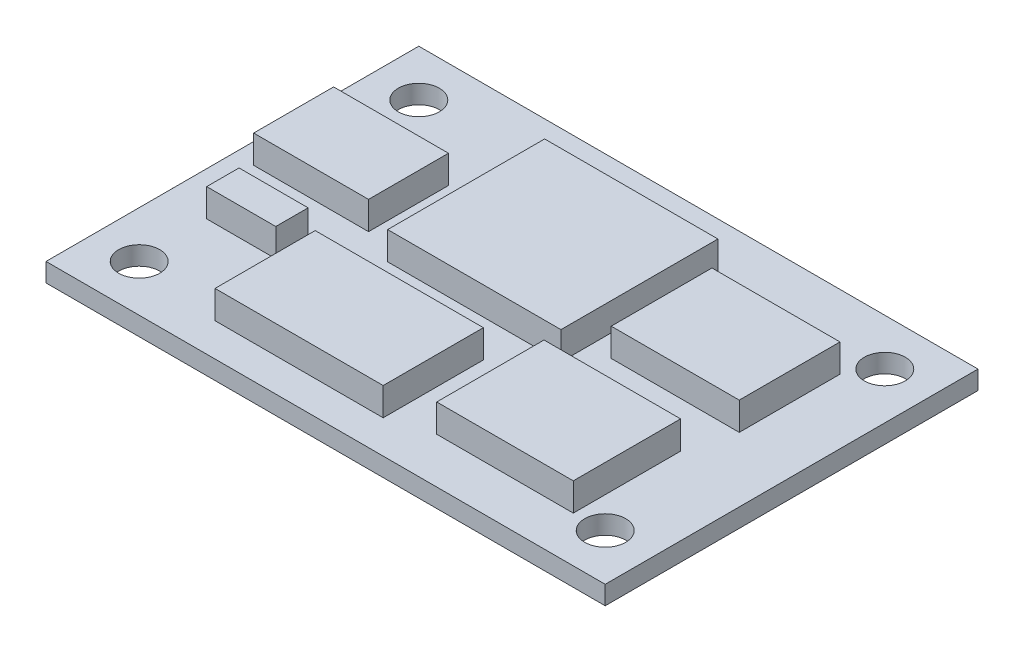
ISO-10303-21;
HEADER;
FILE_DESCRIPTION(('STEP AP214'),'2;1');
FILE_NAME('part.step','',(''),(''),'','','');
FILE_SCHEMA(('AUTOMOTIVE_DESIGN { 1 0 10303 214 1 1 1 1 }'));
ENDSEC;
DATA;
#1=APPLICATION_CONTEXT('core data for automotive mechanical design processes');
#2=APPLICATION_PROTOCOL_DEFINITION('international standard','automotive_design',2000,#1);
#3=PRODUCT_CONTEXT('',#1,'mechanical');
#4=PRODUCT('Part','Part','',(#3));
#5=PRODUCT_RELATED_PRODUCT_CATEGORY('part','',(#4));
#6=PRODUCT_DEFINITION_FORMATION('','',#4);
#7=PRODUCT_DEFINITION_CONTEXT('part definition',#1,'design');
#8=PRODUCT_DEFINITION('design','',#6,#7);
#9=PRODUCT_DEFINITION_SHAPE('','',#8);
#10=(LENGTH_UNIT() NAMED_UNIT(*) SI_UNIT(.MILLI.,.METRE.));
#11=(NAMED_UNIT(*) PLANE_ANGLE_UNIT() SI_UNIT($,.RADIAN.));
#12=(NAMED_UNIT(*) SI_UNIT($,.STERADIAN.) SOLID_ANGLE_UNIT());
#13=UNCERTAINTY_MEASURE_WITH_UNIT(LENGTH_MEASURE(1.E-05),#10,'distance_accuracy_value','');
#14=(GEOMETRIC_REPRESENTATION_CONTEXT(3) GLOBAL_UNCERTAINTY_ASSIGNED_CONTEXT((#13)) GLOBAL_UNIT_ASSIGNED_CONTEXT((#10,
#11,#12)) REPRESENTATION_CONTEXT('',''));
#15=CARTESIAN_POINT('',(0.,0.,0.));
#16=DIRECTION('',(0.,0.,1.));
#17=DIRECTION('',(1.,0.,0.));
#18=AXIS2_PLACEMENT_3D('',#15,#16,#17);
#19=CARTESIAN_POINT('',(0.,2.,0.));
#20=DIRECTION('',(0.,1.,0.));
#21=DIRECTION('',(0.,0.,1.));
#22=AXIS2_PLACEMENT_3D('',#19,#20,#21);
#23=PLANE('',#22);
#24=CARTESIAN_POINT('',(-25.,2.,-15.));
#25=DIRECTION('',(0.,1.,0.));
#26=DIRECTION('',(0.,0.,1.));
#27=AXIS2_PLACEMENT_3D('',#24,#25,#26);
#28=CIRCLE('',#27,2.2);
#29=CARTESIAN_POINT('',(-25.,2.,-12.8));
#30=VERTEX_POINT('',#29);
#31=EDGE_CURVE('E823',#30,#30,#28,.T.);
#32=ORIENTED_EDGE('',*,*,#31,.F.);
#33=EDGE_LOOP('',(#32));
#34=FACE_BOUND('',#33,.T.);
#35=CARTESIAN_POINT('',(25.,2.,-15.));
#36=DIRECTION('',(0.,1.,0.));
#37=DIRECTION('',(0.,0.,1.));
#38=AXIS2_PLACEMENT_3D('',#35,#36,#37);
#39=CIRCLE('',#38,2.2);
#40=CARTESIAN_POINT('',(25.,2.,-12.8));
#41=VERTEX_POINT('',#40);
#42=EDGE_CURVE('E825',#41,#41,#39,.T.);
#43=ORIENTED_EDGE('',*,*,#42,.F.);
#44=EDGE_LOOP('',(#43));
#45=FACE_BOUND('',#44,.T.);
#46=CARTESIAN_POINT('',(25.,2.,15.));
#47=DIRECTION('',(0.,1.,0.));
#48=DIRECTION('',(0.,0.,1.));
#49=AXIS2_PLACEMENT_3D('',#46,#47,#48);
#50=CIRCLE('',#49,2.2);
#51=CARTESIAN_POINT('',(25.,2.,17.2));
#52=VERTEX_POINT('',#51);
#53=EDGE_CURVE('E833',#52,#52,#50,.T.);
#54=ORIENTED_EDGE('',*,*,#53,.F.);
#55=EDGE_LOOP('',(#54));
#56=FACE_BOUND('',#55,.T.);
#57=CARTESIAN_POINT('',(-25.,2.,15.));
#58=DIRECTION('',(0.,1.,0.));
#59=DIRECTION('',(0.,0.,1.));
#60=AXIS2_PLACEMENT_3D('',#57,#58,#59);
#61=CIRCLE('',#60,2.2);
#62=CARTESIAN_POINT('',(-25.,2.,17.2));
#63=VERTEX_POINT('',#62);
#64=EDGE_CURVE('E839',#63,#63,#61,.T.);
#65=ORIENTED_EDGE('',*,*,#64,.F.);
#66=EDGE_LOOP('',(#65));
#67=FACE_BOUND('',#66,.T.);
#68=DIRECTION('',(-1.,0.,0.));
#69=VECTOR('',#68,1.);
#70=CARTESIAN_POINT('',(7.01914534805326,2.,3.58394866051981));
#71=LINE('',#70,#69);
#72=CARTESIAN_POINT('',(21.6740380104312,2.,3.58394866051981));
#73=VERTEX_POINT('',#72);
#74=CARTESIAN_POINT('',(7.01914534805326,2.,3.58394866051981));
#75=VERTEX_POINT('',#74);
#76=EDGE_CURVE('E247',#73,#75,#71,.T.);
#77=ORIENTED_EDGE('',*,*,#76,.F.);
#78=DIRECTION('',(0.,0.,-1.));
#79=VECTOR('',#78,1.);
#80=CARTESIAN_POINT('',(21.6740380104312,2.,3.58394866051981));
#81=LINE('',#80,#79);
#82=CARTESIAN_POINT('',(21.6740380104312,2.,15.0978446505121));
#83=VERTEX_POINT('',#82);
#84=EDGE_CURVE('E244',#83,#73,#81,.T.);
#85=ORIENTED_EDGE('',*,*,#84,.F.);
#86=DIRECTION('',(1.,0.,0.));
#87=VECTOR('',#86,1.);
#88=CARTESIAN_POINT('',(7.01914534805326,2.,15.0978446505121));
#89=LINE('',#88,#87);
#90=CARTESIAN_POINT('',(7.01914534805326,2.,15.0978446505121));
#91=VERTEX_POINT('',#90);
#92=EDGE_CURVE('E256',#91,#83,#89,.T.);
#93=ORIENTED_EDGE('',*,*,#92,.F.);
#94=DIRECTION('',(0.,0.,1.));
#95=VECTOR('',#94,1.);
#96=CARTESIAN_POINT('',(7.01914534805326,2.,3.58394866051981));
#97=LINE('',#96,#95);
#98=EDGE_CURVE('E264',#75,#91,#97,.T.);
#99=ORIENTED_EDGE('',*,*,#98,.F.);
#100=EDGE_LOOP('',(#77,#85,#93,#99));
#101=FACE_BOUND('',#100,.T.);
#102=DIRECTION('',(1.,0.,0.));
#103=VECTOR('',#102,1.);
#104=CARTESIAN_POINT('',(6.96204624759389,2.,1.70936498631136));
#105=LINE('',#104,#103);
#106=CARTESIAN_POINT('',(-11.6307817870052,2.,1.70936498631136));
#107=VERTEX_POINT('',#106);
#108=CARTESIAN_POINT('',(6.96204624759389,2.,1.70936498631136));
#109=VERTEX_POINT('',#108);
#110=EDGE_CURVE('E318',#107,#109,#105,.T.);
#111=ORIENTED_EDGE('',*,*,#110,.F.);
#112=DIRECTION('',(0.,0.,1.));
#113=VECTOR('',#112,1.);
#114=CARTESIAN_POINT('',(-11.6307817870052,2.,-15.1333634497064));
#115=LINE('',#114,#113);
#116=CARTESIAN_POINT('',(-11.6307817870052,2.,-15.1333634497064));
#117=VERTEX_POINT('',#116);
#118=EDGE_CURVE('E304',#117,#107,#115,.T.);
#119=ORIENTED_EDGE('',*,*,#118,.F.);
#120=DIRECTION('',(-1.,0.,0.));
#121=VECTOR('',#120,1.);
#122=CARTESIAN_POINT('',(6.96204624759389,2.,-15.1333634497064));
#123=LINE('',#122,#121);
#124=CARTESIAN_POINT('',(6.96204624759389,2.,-15.1333634497064));
#125=VERTEX_POINT('',#124);
#126=EDGE_CURVE('E309',#125,#117,#123,.T.);
#127=ORIENTED_EDGE('',*,*,#126,.F.);
#128=DIRECTION('',(0.,0.,-1.));
#129=VECTOR('',#128,1.);
#130=CARTESIAN_POINT('',(6.96204624759389,2.,-15.1333634497064));
#131=LINE('',#130,#129);
#132=EDGE_CURVE('E320',#109,#125,#131,.T.);
#133=ORIENTED_EDGE('',*,*,#132,.F.);
#134=EDGE_LOOP('',(#111,#119,#127,#133));
#135=FACE_BOUND('',#134,.T.);
#136=DIRECTION('',(1.,0.,0.));
#137=VECTOR('',#136,1.);
#138=CARTESIAN_POINT('',(-15.4625245919533,2.,-0.070739530755759));
#139=LINE('',#138,#137);
#140=CARTESIAN_POINT('',(-27.788807655071,2.,-0.0707395307557573));
#141=VERTEX_POINT('',#140);
#142=CARTESIAN_POINT('',(-15.4625245919533,2.,-0.070739530755759));
#143=VERTEX_POINT('',#142);
#144=EDGE_CURVE('E376',#141,#143,#139,.T.);
#145=ORIENTED_EDGE('',*,*,#144,.F.);
#146=DIRECTION('',(0.,0.,1.));
#147=VECTOR('',#146,1.);
#148=CARTESIAN_POINT('',(-27.788807655071,2.,-8.64585092567438));
#149=LINE('',#148,#147);
#150=CARTESIAN_POINT('',(-27.788807655071,2.,-8.64585092567438));
#151=VERTEX_POINT('',#150);
#152=EDGE_CURVE('E362',#151,#141,#149,.T.);
#153=ORIENTED_EDGE('',*,*,#152,.F.);
#154=DIRECTION('',(-1.,0.,0.));
#155=VECTOR('',#154,1.);
#156=CARTESIAN_POINT('',(-15.4625245919533,2.,-8.64585092567438));
#157=LINE('',#156,#155);
#158=CARTESIAN_POINT('',(-15.4625245919533,2.,-8.64585092567438));
#159=VERTEX_POINT('',#158);
#160=EDGE_CURVE('E367',#159,#151,#157,.T.);
#161=ORIENTED_EDGE('',*,*,#160,.F.);
#162=DIRECTION('',(0.,0.,-1.));
#163=VECTOR('',#162,1.);
#164=CARTESIAN_POINT('',(-15.4625245919533,2.,-8.64585092567438));
#165=LINE('',#164,#163);
#166=EDGE_CURVE('E378',#143,#159,#165,.T.);
#167=ORIENTED_EDGE('',*,*,#166,.F.);
#168=EDGE_LOOP('',(#145,#153,#161,#167));
#169=FACE_BOUND('',#168,.T.);
#170=DIRECTION('',(0.,0.,1.));
#171=VECTOR('',#170,1.);
#172=CARTESIAN_POINT('',(-30.,2.,20.));
#173=LINE('',#172,#171);
#174=CARTESIAN_POINT('',(-30.,2.,-20.));
#175=VERTEX_POINT('',#174);
#176=CARTESIAN_POINT('',(-30.,2.,20.));
#177=VERTEX_POINT('',#176);
#178=EDGE_CURVE('E392',#175,#177,#173,.T.);
#179=ORIENTED_EDGE('',*,*,#178,.T.);
#180=DIRECTION('',(1.,0.,0.));
#181=VECTOR('',#180,1.);
#182=CARTESIAN_POINT('',(30.,2.,20.));
#183=LINE('',#182,#181);
#184=CARTESIAN_POINT('',(30.,2.,20.));
#185=VERTEX_POINT('',#184);
#186=EDGE_CURVE('E395',#177,#185,#183,.T.);
#187=ORIENTED_EDGE('',*,*,#186,.T.);
#188=DIRECTION('',(0.,0.,-1.));
#189=VECTOR('',#188,1.);
#190=CARTESIAN_POINT('',(30.,2.,20.));
#191=LINE('',#190,#189);
#192=CARTESIAN_POINT('',(30.,2.,-20.));
#193=VERTEX_POINT('',#192);
#194=EDGE_CURVE('E398',#185,#193,#191,.T.);
#195=ORIENTED_EDGE('',*,*,#194,.T.);
#196=DIRECTION('',(-1.,0.,0.));
#197=VECTOR('',#196,1.);
#198=CARTESIAN_POINT('',(30.,2.,-20.));
#199=LINE('',#198,#197);
#200=EDGE_CURVE('E400',#193,#175,#199,.T.);
#201=ORIENTED_EDGE('',*,*,#200,.T.);
#202=EDGE_LOOP('',(#179,#187,#195,#201));
#203=FACE_BOUND('',#202,.T.);
#204=DIRECTION('',(1.,0.,0.));
#205=VECTOR('',#204,1.);
#206=CARTESIAN_POINT('',(23.0758575930636,2.,-1.30752796441413));
#207=LINE('',#206,#205);
#208=CARTESIAN_POINT('',(9.33847301958934,2.,-1.30752796441413));
#209=VERTEX_POINT('',#208);
#210=CARTESIAN_POINT('',(23.0758575930636,2.,-1.30752796441413));
#211=VERTEX_POINT('',#210);
#212=EDGE_CURVE('E347',#209,#211,#207,.T.);
#213=ORIENTED_EDGE('',*,*,#212,.F.);
#214=DIRECTION('',(0.,0.,1.));
#215=VECTOR('',#214,1.);
#216=CARTESIAN_POINT('',(9.33847301958934,2.,-12.1164704989809));
#217=LINE('',#216,#215);
#218=CARTESIAN_POINT('',(9.33847301958934,2.,-12.1164704989809));
#219=VERTEX_POINT('',#218);
#220=EDGE_CURVE('E333',#219,#209,#217,.T.);
#221=ORIENTED_EDGE('',*,*,#220,.F.);
#222=DIRECTION('',(-1.,0.,0.));
#223=VECTOR('',#222,1.);
#224=CARTESIAN_POINT('',(23.0758575930636,2.,-12.1164704989809));
#225=LINE('',#224,#223);
#226=CARTESIAN_POINT('',(23.0758575930636,2.,-12.1164704989809));
#227=VERTEX_POINT('',#226);
#228=EDGE_CURVE('E338',#227,#219,#225,.T.);
#229=ORIENTED_EDGE('',*,*,#228,.F.);
#230=DIRECTION('',(0.,0.,-1.));
#231=VECTOR('',#230,1.);
#232=CARTESIAN_POINT('',(23.0758575930636,2.,-12.1164704989809));
#233=LINE('',#232,#231);
#234=EDGE_CURVE('E349',#211,#227,#233,.T.);
#235=ORIENTED_EDGE('',*,*,#234,.F.);
#236=EDGE_LOOP('',(#213,#221,#229,#235));
#237=FACE_BOUND('',#236,.T.);
#238=DIRECTION('',(1.,0.,0.));
#239=VECTOR('',#238,1.);
#240=CARTESIAN_POINT('',(-17.9198734394674,2.,7.42768358096558));
#241=LINE('',#240,#239);
#242=CARTESIAN_POINT('',(-25.3314588075568,2.,7.42768358096558));
#243=VERTEX_POINT('',#242);
#244=CARTESIAN_POINT('',(-17.9198734394674,2.,7.42768358096558));
#245=VERTEX_POINT('',#244);
#246=EDGE_CURVE('E289',#243,#245,#241,.T.);
#247=ORIENTED_EDGE('',*,*,#246,.F.);
#248=DIRECTION('',(0.,0.,1.));
#249=VECTOR('',#248,1.);
#250=CARTESIAN_POINT('',(-25.3314588075568,2.,3.9564800150288));
#251=LINE('',#250,#249);
#252=CARTESIAN_POINT('',(-25.3314588075568,2.,3.9564800150288));
#253=VERTEX_POINT('',#252);
#254=EDGE_CURVE('E275',#253,#243,#251,.T.);
#255=ORIENTED_EDGE('',*,*,#254,.F.);
#256=DIRECTION('',(-1.,0.,0.));
#257=VECTOR('',#256,1.);
#258=CARTESIAN_POINT('',(-17.9198734394674,2.,3.9564800150288));
#259=LINE('',#258,#257);
#260=CARTESIAN_POINT('',(-17.9198734394674,2.,3.9564800150288));
#261=VERTEX_POINT('',#260);
#262=EDGE_CURVE('E280',#261,#253,#259,.T.);
#263=ORIENTED_EDGE('',*,*,#262,.F.);
#264=DIRECTION('',(0.,0.,-1.));
#265=VECTOR('',#264,1.);
#266=CARTESIAN_POINT('',(-17.9198734394674,2.,3.9564800150288));
#267=LINE('',#266,#265);
#268=EDGE_CURVE('E291',#245,#261,#267,.T.);
#269=ORIENTED_EDGE('',*,*,#268,.F.);
#270=EDGE_LOOP('',(#247,#255,#263,#269));
#271=FACE_BOUND('',#270,.T.);
#272=DIRECTION('',(1.,0.,0.));
#273=VECTOR('',#272,1.);
#274=CARTESIAN_POINT('',(2.6187010722979,2.,16.4404738050962));
#275=LINE('',#274,#273);
#276=CARTESIAN_POINT('',(-15.4248734619714,2.,16.4404738050962));
#277=VERTEX_POINT('',#276);
#278=CARTESIAN_POINT('',(2.6187010722979,2.,16.4404738050962));
#279=VERTEX_POINT('',#278);
#280=EDGE_CURVE('E849',#277,#279,#275,.T.);
#281=ORIENTED_EDGE('',*,*,#280,.F.);
#282=DIRECTION('',(0.,0.,1.));
#283=VECTOR('',#282,1.);
#284=CARTESIAN_POINT('',(-15.4248734619714,2.,5.69208179799719));
#285=LINE('',#284,#283);
#286=CARTESIAN_POINT('',(-15.4248734619714,2.,5.69208179799719));
#287=VERTEX_POINT('',#286);
#288=EDGE_CURVE('E242',#287,#277,#285,.T.);
#289=ORIENTED_EDGE('',*,*,#288,.F.);
#290=DIRECTION('',(-1.,0.,0.));
#291=VECTOR('',#290,1.);
#292=CARTESIAN_POINT('',(2.6187010722979,2.,5.69208179799719));
#293=LINE('',#292,#291);
#294=CARTESIAN_POINT('',(2.6187010722979,2.,5.69208179799719));
#295=VERTEX_POINT('',#294);
#296=EDGE_CURVE('E238',#295,#287,#293,.T.);
#297=ORIENTED_EDGE('',*,*,#296,.F.);
#298=DIRECTION('',(0.,0.,-1.));
#299=VECTOR('',#298,1.);
#300=CARTESIAN_POINT('',(2.6187010722979,2.,5.69208179799719));
#301=LINE('',#300,#299);
#302=EDGE_CURVE('E851',#279,#295,#301,.T.);
#303=ORIENTED_EDGE('',*,*,#302,.F.);
#304=EDGE_LOOP('',(#281,#289,#297,#303));
#305=FACE_BOUND('',#304,.T.);
#306=ADVANCED_FACE('F33',(#34,#45,#56,#67,#101,#135,#169,#203,#237,#271,#305),#23,.T.);
#307=CARTESIAN_POINT('',(-30.,2.,20.));
#308=DIRECTION('',(1.,0.,0.));
#309=DIRECTION('',(0.,0.,-1.));
#310=AXIS2_PLACEMENT_3D('',#307,#308,#309);
#311=PLANE('',#310);
#312=DIRECTION('',(0.,0.,1.));
#313=VECTOR('',#312,1.);
#314=CARTESIAN_POINT('',(-30.,0.,20.));
#315=LINE('',#314,#313);
#316=CARTESIAN_POINT('',(-30.,0.,-20.));
#317=VERTEX_POINT('',#316);
#318=CARTESIAN_POINT('',(-30.,0.,20.));
#319=VERTEX_POINT('',#318);
#320=EDGE_CURVE('E391',#317,#319,#315,.T.);
#321=ORIENTED_EDGE('',*,*,#320,.T.);
#322=DIRECTION('',(0.,-1.,0.));
#323=VECTOR('',#322,1.);
#324=CARTESIAN_POINT('',(-30.,2.,20.));
#325=LINE('',#324,#323);
#326=EDGE_CURVE('E11',#177,#319,#325,.T.);
#327=ORIENTED_EDGE('',*,*,#326,.F.);
#328=ORIENTED_EDGE('',*,*,#178,.F.);
#329=DIRECTION('',(0.,-1.,0.));
#330=VECTOR('',#329,1.);
#331=CARTESIAN_POINT('',(-30.,2.,-20.));
#332=LINE('',#331,#330);
#333=EDGE_CURVE('E402',#175,#317,#332,.T.);
#334=ORIENTED_EDGE('',*,*,#333,.T.);
#335=EDGE_LOOP('',(#321,#327,#328,#334));
#336=FACE_BOUND('',#335,.T.);
#337=ADVANCED_FACE('F35',(#336),#311,.F.);
#338=CARTESIAN_POINT('',(30.,2.,20.));
#339=DIRECTION('',(0.,0.,-1.));
#340=DIRECTION('',(-1.,0.,0.));
#341=AXIS2_PLACEMENT_3D('',#338,#339,#340);
#342=PLANE('',#341);
#343=DIRECTION('',(1.,0.,0.));
#344=VECTOR('',#343,1.);
#345=CARTESIAN_POINT('',(30.,0.,20.));
#346=LINE('',#345,#344);
#347=CARTESIAN_POINT('',(30.,0.,20.));
#348=VERTEX_POINT('',#347);
#349=EDGE_CURVE('E405',#319,#348,#346,.T.);
#350=ORIENTED_EDGE('',*,*,#349,.T.);
#351=DIRECTION('',(0.,-1.,0.));
#352=VECTOR('',#351,1.);
#353=CARTESIAN_POINT('',(30.,2.,20.));
#354=LINE('',#353,#352);
#355=EDGE_CURVE('E41',#185,#348,#354,.T.);
#356=ORIENTED_EDGE('',*,*,#355,.F.);
#357=ORIENTED_EDGE('',*,*,#186,.F.);
#358=ORIENTED_EDGE('',*,*,#326,.T.);
#359=EDGE_LOOP('',(#350,#356,#357,#358));
#360=FACE_BOUND('',#359,.T.);
#361=ADVANCED_FACE('F435',(#360),#342,.F.);
#362=CARTESIAN_POINT('',(30.,2.,20.));
#363=DIRECTION('',(-1.,0.,0.));
#364=DIRECTION('',(0.,0.,1.));
#365=AXIS2_PLACEMENT_3D('',#362,#363,#364);
#366=PLANE('',#365);
#367=DIRECTION('',(0.,0.,-1.));
#368=VECTOR('',#367,1.);
#369=CARTESIAN_POINT('',(30.,0.,20.));
#370=LINE('',#369,#368);
#371=CARTESIAN_POINT('',(30.,0.,-20.));
#372=VERTEX_POINT('',#371);
#373=EDGE_CURVE('E407',#348,#372,#370,.T.);
#374=ORIENTED_EDGE('',*,*,#373,.T.);
#375=DIRECTION('',(0.,-1.,0.));
#376=VECTOR('',#375,1.);
#377=CARTESIAN_POINT('',(30.,2.,-20.));
#378=LINE('',#377,#376);
#379=EDGE_CURVE('E412',#193,#372,#378,.T.);
#380=ORIENTED_EDGE('',*,*,#379,.F.);
#381=ORIENTED_EDGE('',*,*,#194,.F.);
#382=ORIENTED_EDGE('',*,*,#355,.T.);
#383=EDGE_LOOP('',(#374,#380,#381,#382));
#384=FACE_BOUND('',#383,.T.);
#385=ADVANCED_FACE('F419',(#384),#366,.F.);
#386=CARTESIAN_POINT('',(30.,2.,-20.));
#387=DIRECTION('',(0.,0.,1.));
#388=DIRECTION('',(1.,0.,0.));
#389=AXIS2_PLACEMENT_3D('',#386,#387,#388);
#390=PLANE('',#389);
#391=DIRECTION('',(-1.,0.,0.));
#392=VECTOR('',#391,1.);
#393=CARTESIAN_POINT('',(30.,0.,-20.));
#394=LINE('',#393,#392);
#395=EDGE_CURVE('E396',#372,#317,#394,.T.);
#396=ORIENTED_EDGE('',*,*,#395,.T.);
#397=ORIENTED_EDGE('',*,*,#333,.F.);
#398=ORIENTED_EDGE('',*,*,#200,.F.);
#399=ORIENTED_EDGE('',*,*,#379,.T.);
#400=EDGE_LOOP('',(#396,#397,#398,#399));
#401=FACE_BOUND('',#400,.T.);
#402=ADVANCED_FACE('F428',(#401),#390,.F.);
#403=CARTESIAN_POINT('',(0.,0.,0.));
#404=DIRECTION('',(0.,1.,0.));
#405=DIRECTION('',(0.,0.,1.));
#406=AXIS2_PLACEMENT_3D('',#403,#404,#405);
#407=PLANE('',#406);
#408=CARTESIAN_POINT('',(-25.,0.,-15.));
#409=DIRECTION('',(0.,1.,0.));
#410=DIRECTION('',(0.,0.,1.));
#411=AXIS2_PLACEMENT_3D('',#408,#409,#410);
#412=CIRCLE('',#411,2.2);
#413=CARTESIAN_POINT('',(-25.,0.,-12.8));
#414=VERTEX_POINT('',#413);
#415=EDGE_CURVE('E821',#414,#414,#412,.T.);
#416=ORIENTED_EDGE('',*,*,#415,.T.);
#417=EDGE_LOOP('',(#416));
#418=FACE_BOUND('',#417,.T.);
#419=CARTESIAN_POINT('',(25.,0.,-15.));
#420=DIRECTION('',(0.,1.,0.));
#421=DIRECTION('',(0.,0.,1.));
#422=AXIS2_PLACEMENT_3D('',#419,#420,#421);
#423=CIRCLE('',#422,2.2);
#424=CARTESIAN_POINT('',(25.,0.,-12.8));
#425=VERTEX_POINT('',#424);
#426=EDGE_CURVE('E830',#425,#425,#423,.T.);
#427=ORIENTED_EDGE('',*,*,#426,.T.);
#428=EDGE_LOOP('',(#427));
#429=FACE_BOUND('',#428,.T.);
#430=CARTESIAN_POINT('',(25.,0.,15.));
#431=DIRECTION('',(0.,1.,0.));
#432=DIRECTION('',(0.,0.,1.));
#433=AXIS2_PLACEMENT_3D('',#430,#431,#432);
#434=CIRCLE('',#433,2.2);
#435=CARTESIAN_POINT('',(25.,0.,17.2));
#436=VERTEX_POINT('',#435);
#437=EDGE_CURVE('E836',#436,#436,#434,.T.);
#438=ORIENTED_EDGE('',*,*,#437,.T.);
#439=EDGE_LOOP('',(#438));
#440=FACE_BOUND('',#439,.T.);
#441=CARTESIAN_POINT('',(-25.,0.,15.));
#442=DIRECTION('',(0.,1.,0.));
#443=DIRECTION('',(0.,0.,1.));
#444=AXIS2_PLACEMENT_3D('',#441,#442,#443);
#445=CIRCLE('',#444,2.2);
#446=CARTESIAN_POINT('',(-25.,0.,17.2));
#447=VERTEX_POINT('',#446);
#448=EDGE_CURVE('E842',#447,#447,#445,.T.);
#449=ORIENTED_EDGE('',*,*,#448,.T.);
#450=EDGE_LOOP('',(#449));
#451=FACE_BOUND('',#450,.T.);
#452=ORIENTED_EDGE('',*,*,#320,.F.);
#453=ORIENTED_EDGE('',*,*,#395,.F.);
#454=ORIENTED_EDGE('',*,*,#373,.F.);
#455=ORIENTED_EDGE('',*,*,#349,.F.);
#456=EDGE_LOOP('',(#452,#453,#454,#455));
#457=FACE_BOUND('',#456,.T.);
#458=ADVANCED_FACE('F425',(#418,#429,#440,#451,#457),#407,.F.);
#459=CARTESIAN_POINT('',(-27.788807655071,5.,-8.64585092567438));
#460=DIRECTION('',(1.,0.,0.));
#461=DIRECTION('',(0.,0.,-1.));
#462=AXIS2_PLACEMENT_3D('',#459,#460,#461);
#463=PLANE('',#462);
#464=ORIENTED_EDGE('',*,*,#152,.T.);
#465=DIRECTION('',(0.,-1.,0.));
#466=VECTOR('',#465,1.);
#467=CARTESIAN_POINT('',(-27.788807655071,5.,-0.0707395307557573));
#468=LINE('',#467,#466);
#469=CARTESIAN_POINT('',(-27.788807655071,5.,-0.0707395307557573));
#470=VERTEX_POINT('',#469);
#471=EDGE_CURVE('E389',#470,#141,#468,.T.);
#472=ORIENTED_EDGE('',*,*,#471,.F.);
#473=DIRECTION('',(0.,0.,1.));
#474=VECTOR('',#473,1.);
#475=CARTESIAN_POINT('',(-27.788807655071,5.,-8.64585092567438));
#476=LINE('',#475,#474);
#477=CARTESIAN_POINT('',(-27.788807655071,5.,-8.64585092567438));
#478=VERTEX_POINT('',#477);
#479=EDGE_CURVE('E363',#478,#470,#476,.T.);
#480=ORIENTED_EDGE('',*,*,#479,.F.);
#481=DIRECTION('',(0.,-1.,0.));
#482=VECTOR('',#481,1.);
#483=CARTESIAN_POINT('',(-27.788807655071,5.,-8.64585092567438));
#484=LINE('',#483,#482);
#485=EDGE_CURVE('E373',#478,#151,#484,.T.);
#486=ORIENTED_EDGE('',*,*,#485,.T.);
#487=EDGE_LOOP('',(#464,#472,#480,#486));
#488=FACE_BOUND('',#487,.T.);
#489=ADVANCED_FACE('F451',(#488),#463,.F.);
#490=CARTESIAN_POINT('',(-15.4625245919533,5.,-0.070739530755759));
#491=DIRECTION('',(0.,0.,-1.));
#492=DIRECTION('',(-1.,0.,0.));
#493=AXIS2_PLACEMENT_3D('',#490,#491,#492);
#494=PLANE('',#493);
#495=ORIENTED_EDGE('',*,*,#144,.T.);
#496=DIRECTION('',(0.,-1.,0.));
#497=VECTOR('',#496,1.);
#498=CARTESIAN_POINT('',(-15.4625245919533,5.,-0.070739530755759));
#499=LINE('',#498,#497);
#500=CARTESIAN_POINT('',(-15.4625245919533,5.,-0.070739530755759));
#501=VERTEX_POINT('',#500);
#502=EDGE_CURVE('E386',#501,#143,#499,.T.);
#503=ORIENTED_EDGE('',*,*,#502,.F.);
#504=DIRECTION('',(1.,0.,0.));
#505=VECTOR('',#504,1.);
#506=CARTESIAN_POINT('',(-15.4625245919533,5.,-0.070739530755759));
#507=LINE('',#506,#505);
#508=EDGE_CURVE('E366',#470,#501,#507,.T.);
#509=ORIENTED_EDGE('',*,*,#508,.F.);
#510=ORIENTED_EDGE('',*,*,#471,.T.);
#511=EDGE_LOOP('',(#495,#503,#509,#510));
#512=FACE_BOUND('',#511,.T.);
#513=ADVANCED_FACE('F472',(#512),#494,.F.);
#514=CARTESIAN_POINT('',(-15.4625245919533,5.,-8.64585092567438));
#515=DIRECTION('',(-1.,0.,0.));
#516=DIRECTION('',(0.,0.,1.));
#517=AXIS2_PLACEMENT_3D('',#514,#515,#516);
#518=PLANE('',#517);
#519=ORIENTED_EDGE('',*,*,#166,.T.);
#520=DIRECTION('',(0.,-1.,0.));
#521=VECTOR('',#520,1.);
#522=CARTESIAN_POINT('',(-15.4625245919533,5.,-8.64585092567438));
#523=LINE('',#522,#521);
#524=CARTESIAN_POINT('',(-15.4625245919533,5.,-8.64585092567438));
#525=VERTEX_POINT('',#524);
#526=EDGE_CURVE('E384',#525,#159,#523,.T.);
#527=ORIENTED_EDGE('',*,*,#526,.F.);
#528=DIRECTION('',(0.,0.,-1.));
#529=VECTOR('',#528,1.);
#530=CARTESIAN_POINT('',(-15.4625245919533,5.,-8.64585092567438));
#531=LINE('',#530,#529);
#532=EDGE_CURVE('E369',#501,#525,#531,.T.);
#533=ORIENTED_EDGE('',*,*,#532,.F.);
#534=ORIENTED_EDGE('',*,*,#502,.T.);
#535=EDGE_LOOP('',(#519,#527,#533,#534));
#536=FACE_BOUND('',#535,.T.);
#537=ADVANCED_FACE('F479',(#536),#518,.F.);
#538=CARTESIAN_POINT('',(-15.4625245919533,5.,-8.64585092567438));
#539=DIRECTION('',(0.,0.,1.));
#540=DIRECTION('',(1.,0.,0.));
#541=AXIS2_PLACEMENT_3D('',#538,#539,#540);
#542=PLANE('',#541);
#543=ORIENTED_EDGE('',*,*,#160,.T.);
#544=ORIENTED_EDGE('',*,*,#485,.F.);
#545=DIRECTION('',(-1.,0.,0.));
#546=VECTOR('',#545,1.);
#547=CARTESIAN_POINT('',(-15.4625245919533,5.,-8.64585092567438));
#548=LINE('',#547,#546);
#549=EDGE_CURVE('E371',#525,#478,#548,.T.);
#550=ORIENTED_EDGE('',*,*,#549,.F.);
#551=ORIENTED_EDGE('',*,*,#526,.T.);
#552=EDGE_LOOP('',(#543,#544,#550,#551));
#553=FACE_BOUND('',#552,.T.);
#554=ADVANCED_FACE('F486',(#553),#542,.F.);
#555=CARTESIAN_POINT('',(0.,5.,0.));
#556=DIRECTION('',(0.,-1.,0.));
#557=DIRECTION('',(0.,0.,-1.));
#558=AXIS2_PLACEMENT_3D('',#555,#556,#557);
#559=PLANE('',#558);
#560=ORIENTED_EDGE('',*,*,#479,.T.);
#561=ORIENTED_EDGE('',*,*,#508,.T.);
#562=ORIENTED_EDGE('',*,*,#532,.T.);
#563=ORIENTED_EDGE('',*,*,#549,.T.);
#564=EDGE_LOOP('',(#560,#561,#562,#563));
#565=FACE_BOUND('',#564,.T.);
#566=ADVANCED_FACE('F494',(#565),#559,.F.);
#567=CARTESIAN_POINT('',(9.33847301958934,5.,-12.1164704989809));
#568=DIRECTION('',(1.,0.,0.));
#569=DIRECTION('',(0.,0.,-1.));
#570=AXIS2_PLACEMENT_3D('',#567,#568,#569);
#571=PLANE('',#570);
#572=ORIENTED_EDGE('',*,*,#220,.T.);
#573=DIRECTION('',(0.,-1.,0.));
#574=VECTOR('',#573,1.);
#575=CARTESIAN_POINT('',(9.33847301958934,5.,-1.30752796441413));
#576=LINE('',#575,#574);
#577=CARTESIAN_POINT('',(9.33847301958934,5.,-1.30752796441413));
#578=VERTEX_POINT('',#577);
#579=EDGE_CURVE('E360',#578,#209,#576,.T.);
#580=ORIENTED_EDGE('',*,*,#579,.F.);
#581=DIRECTION('',(0.,0.,1.));
#582=VECTOR('',#581,1.);
#583=CARTESIAN_POINT('',(9.33847301958934,5.,-12.1164704989809));
#584=LINE('',#583,#582);
#585=CARTESIAN_POINT('',(9.33847301958934,5.,-12.1164704989809));
#586=VERTEX_POINT('',#585);
#587=EDGE_CURVE('E334',#586,#578,#584,.T.);
#588=ORIENTED_EDGE('',*,*,#587,.F.);
#589=DIRECTION('',(0.,-1.,0.));
#590=VECTOR('',#589,1.);
#591=CARTESIAN_POINT('',(9.33847301958934,5.,-12.1164704989809));
#592=LINE('',#591,#590);
#593=EDGE_CURVE('E344',#586,#219,#592,.T.);
#594=ORIENTED_EDGE('',*,*,#593,.T.);
#595=EDGE_LOOP('',(#572,#580,#588,#594));
#596=FACE_BOUND('',#595,.T.);
#597=ADVANCED_FACE('F502',(#596),#571,.F.);
#598=CARTESIAN_POINT('',(23.0758575930636,5.,-1.30752796441413));
#599=DIRECTION('',(0.,0.,-1.));
#600=DIRECTION('',(-1.,0.,0.));
#601=AXIS2_PLACEMENT_3D('',#598,#599,#600);
#602=PLANE('',#601);
#603=ORIENTED_EDGE('',*,*,#212,.T.);
#604=DIRECTION('',(0.,-1.,0.));
#605=VECTOR('',#604,1.);
#606=CARTESIAN_POINT('',(23.0758575930636,5.,-1.30752796441413));
#607=LINE('',#606,#605);
#608=CARTESIAN_POINT('',(23.0758575930636,5.,-1.30752796441413));
#609=VERTEX_POINT('',#608);
#610=EDGE_CURVE('E357',#609,#211,#607,.T.);
#611=ORIENTED_EDGE('',*,*,#610,.F.);
#612=DIRECTION('',(1.,0.,0.));
#613=VECTOR('',#612,1.);
#614=CARTESIAN_POINT('',(23.0758575930636,5.,-1.30752796441413));
#615=LINE('',#614,#613);
#616=EDGE_CURVE('E337',#578,#609,#615,.T.);
#617=ORIENTED_EDGE('',*,*,#616,.F.);
#618=ORIENTED_EDGE('',*,*,#579,.T.);
#619=EDGE_LOOP('',(#603,#611,#617,#618));
#620=FACE_BOUND('',#619,.T.);
#621=ADVANCED_FACE('F510',(#620),#602,.F.);
#622=CARTESIAN_POINT('',(23.0758575930636,5.,-12.1164704989809));
#623=DIRECTION('',(-1.,0.,0.));
#624=DIRECTION('',(0.,0.,1.));
#625=AXIS2_PLACEMENT_3D('',#622,#623,#624);
#626=PLANE('',#625);
#627=ORIENTED_EDGE('',*,*,#234,.T.);
#628=DIRECTION('',(0.,-1.,0.));
#629=VECTOR('',#628,1.);
#630=CARTESIAN_POINT('',(23.0758575930636,5.,-12.1164704989809));
#631=LINE('',#630,#629);
#632=CARTESIAN_POINT('',(23.0758575930636,5.,-12.1164704989809));
#633=VERTEX_POINT('',#632);
#634=EDGE_CURVE('E355',#633,#227,#631,.T.);
#635=ORIENTED_EDGE('',*,*,#634,.F.);
#636=DIRECTION('',(0.,0.,-1.));
#637=VECTOR('',#636,1.);
#638=CARTESIAN_POINT('',(23.0758575930636,5.,-12.1164704989809));
#639=LINE('',#638,#637);
#640=EDGE_CURVE('E340',#609,#633,#639,.T.);
#641=ORIENTED_EDGE('',*,*,#640,.F.);
#642=ORIENTED_EDGE('',*,*,#610,.T.);
#643=EDGE_LOOP('',(#627,#635,#641,#642));
#644=FACE_BOUND('',#643,.T.);
#645=ADVANCED_FACE('F518',(#644),#626,.F.);
#646=CARTESIAN_POINT('',(23.0758575930636,5.,-12.1164704989809));
#647=DIRECTION('',(0.,0.,1.));
#648=DIRECTION('',(1.,0.,0.));
#649=AXIS2_PLACEMENT_3D('',#646,#647,#648);
#650=PLANE('',#649);
#651=ORIENTED_EDGE('',*,*,#228,.T.);
#652=ORIENTED_EDGE('',*,*,#593,.F.);
#653=DIRECTION('',(-1.,0.,0.));
#654=VECTOR('',#653,1.);
#655=CARTESIAN_POINT('',(23.0758575930636,5.,-12.1164704989809));
#656=LINE('',#655,#654);
#657=EDGE_CURVE('E342',#633,#586,#656,.T.);
#658=ORIENTED_EDGE('',*,*,#657,.F.);
#659=ORIENTED_EDGE('',*,*,#634,.T.);
#660=EDGE_LOOP('',(#651,#652,#658,#659));
#661=FACE_BOUND('',#660,.T.);
#662=ADVANCED_FACE('F526',(#661),#650,.F.);
#663=CARTESIAN_POINT('',(0.,5.,0.));
#664=DIRECTION('',(0.,-1.,0.));
#665=DIRECTION('',(0.,0.,-1.));
#666=AXIS2_PLACEMENT_3D('',#663,#664,#665);
#667=PLANE('',#666);
#668=ORIENTED_EDGE('',*,*,#587,.T.);
#669=ORIENTED_EDGE('',*,*,#616,.T.);
#670=ORIENTED_EDGE('',*,*,#640,.T.);
#671=ORIENTED_EDGE('',*,*,#657,.T.);
#672=EDGE_LOOP('',(#668,#669,#670,#671));
#673=FACE_BOUND('',#672,.T.);
#674=ADVANCED_FACE('F534',(#673),#667,.F.);
#675=CARTESIAN_POINT('',(-11.6307817870052,5.,-15.1333634497064));
#676=DIRECTION('',(1.,0.,0.));
#677=DIRECTION('',(0.,0.,-1.));
#678=AXIS2_PLACEMENT_3D('',#675,#676,#677);
#679=PLANE('',#678);
#680=ORIENTED_EDGE('',*,*,#118,.T.);
#681=DIRECTION('',(0.,-1.,0.));
#682=VECTOR('',#681,1.);
#683=CARTESIAN_POINT('',(-11.6307817870052,5.,1.70936498631136));
#684=LINE('',#683,#682);
#685=CARTESIAN_POINT('',(-11.6307817870052,5.,1.70936498631136));
#686=VERTEX_POINT('',#685);
#687=EDGE_CURVE('E331',#686,#107,#684,.T.);
#688=ORIENTED_EDGE('',*,*,#687,.F.);
#689=DIRECTION('',(0.,0.,1.));
#690=VECTOR('',#689,1.);
#691=CARTESIAN_POINT('',(-11.6307817870052,5.,-15.1333634497064));
#692=LINE('',#691,#690);
#693=CARTESIAN_POINT('',(-11.6307817870052,5.,-15.1333634497064));
#694=VERTEX_POINT('',#693);
#695=EDGE_CURVE('E305',#694,#686,#692,.T.);
#696=ORIENTED_EDGE('',*,*,#695,.F.);
#697=DIRECTION('',(0.,-1.,0.));
#698=VECTOR('',#697,1.);
#699=CARTESIAN_POINT('',(-11.6307817870052,5.,-15.1333634497064));
#700=LINE('',#699,#698);
#701=EDGE_CURVE('E315',#694,#117,#700,.T.);
#702=ORIENTED_EDGE('',*,*,#701,.T.);
#703=EDGE_LOOP('',(#680,#688,#696,#702));
#704=FACE_BOUND('',#703,.T.);
#705=ADVANCED_FACE('F542',(#704),#679,.F.);
#706=CARTESIAN_POINT('',(6.96204624759389,5.,1.70936498631136));
#707=DIRECTION('',(0.,0.,-1.));
#708=DIRECTION('',(-1.,0.,0.));
#709=AXIS2_PLACEMENT_3D('',#706,#707,#708);
#710=PLANE('',#709);
#711=ORIENTED_EDGE('',*,*,#110,.T.);
#712=DIRECTION('',(0.,-1.,0.));
#713=VECTOR('',#712,1.);
#714=CARTESIAN_POINT('',(6.96204624759389,5.,1.70936498631136));
#715=LINE('',#714,#713);
#716=CARTESIAN_POINT('',(6.96204624759389,5.,1.70936498631136));
#717=VERTEX_POINT('',#716);
#718=EDGE_CURVE('E328',#717,#109,#715,.T.);
#719=ORIENTED_EDGE('',*,*,#718,.F.);
#720=DIRECTION('',(1.,0.,0.));
#721=VECTOR('',#720,1.);
#722=CARTESIAN_POINT('',(6.96204624759389,5.,1.70936498631136));
#723=LINE('',#722,#721);
#724=EDGE_CURVE('E308',#686,#717,#723,.T.);
#725=ORIENTED_EDGE('',*,*,#724,.F.);
#726=ORIENTED_EDGE('',*,*,#687,.T.);
#727=EDGE_LOOP('',(#711,#719,#725,#726));
#728=FACE_BOUND('',#727,.T.);
#729=ADVANCED_FACE('F550',(#728),#710,.F.);
#730=CARTESIAN_POINT('',(6.96204624759389,5.,-15.1333634497064));
#731=DIRECTION('',(-1.,0.,0.));
#732=DIRECTION('',(0.,0.,1.));
#733=AXIS2_PLACEMENT_3D('',#730,#731,#732);
#734=PLANE('',#733);
#735=ORIENTED_EDGE('',*,*,#132,.T.);
#736=DIRECTION('',(0.,-1.,0.));
#737=VECTOR('',#736,1.);
#738=CARTESIAN_POINT('',(6.96204624759389,5.,-15.1333634497064));
#739=LINE('',#738,#737);
#740=CARTESIAN_POINT('',(6.96204624759389,5.,-15.1333634497064));
#741=VERTEX_POINT('',#740);
#742=EDGE_CURVE('E326',#741,#125,#739,.T.);
#743=ORIENTED_EDGE('',*,*,#742,.F.);
#744=DIRECTION('',(0.,0.,-1.));
#745=VECTOR('',#744,1.);
#746=CARTESIAN_POINT('',(6.96204624759389,5.,-15.1333634497064));
#747=LINE('',#746,#745);
#748=EDGE_CURVE('E311',#717,#741,#747,.T.);
#749=ORIENTED_EDGE('',*,*,#748,.F.);
#750=ORIENTED_EDGE('',*,*,#718,.T.);
#751=EDGE_LOOP('',(#735,#743,#749,#750));
#752=FACE_BOUND('',#751,.T.);
#753=ADVANCED_FACE('F558',(#752),#734,.F.);
#754=CARTESIAN_POINT('',(6.96204624759389,5.,-15.1333634497064));
#755=DIRECTION('',(0.,0.,1.));
#756=DIRECTION('',(1.,0.,0.));
#757=AXIS2_PLACEMENT_3D('',#754,#755,#756);
#758=PLANE('',#757);
#759=ORIENTED_EDGE('',*,*,#126,.T.);
#760=ORIENTED_EDGE('',*,*,#701,.F.);
#761=DIRECTION('',(-1.,0.,0.));
#762=VECTOR('',#761,1.);
#763=CARTESIAN_POINT('',(6.96204624759389,5.,-15.1333634497064));
#764=LINE('',#763,#762);
#765=EDGE_CURVE('E313',#741,#694,#764,.T.);
#766=ORIENTED_EDGE('',*,*,#765,.F.);
#767=ORIENTED_EDGE('',*,*,#742,.T.);
#768=EDGE_LOOP('',(#759,#760,#766,#767));
#769=FACE_BOUND('',#768,.T.);
#770=ADVANCED_FACE('F566',(#769),#758,.F.);
#771=CARTESIAN_POINT('',(0.,5.,0.));
#772=DIRECTION('',(0.,-1.,0.));
#773=DIRECTION('',(0.,0.,-1.));
#774=AXIS2_PLACEMENT_3D('',#771,#772,#773);
#775=PLANE('',#774);
#776=ORIENTED_EDGE('',*,*,#695,.T.);
#777=ORIENTED_EDGE('',*,*,#724,.T.);
#778=ORIENTED_EDGE('',*,*,#748,.T.);
#779=ORIENTED_EDGE('',*,*,#765,.T.);
#780=EDGE_LOOP('',(#776,#777,#778,#779));
#781=FACE_BOUND('',#780,.T.);
#782=ADVANCED_FACE('F574',(#781),#775,.F.);
#783=CARTESIAN_POINT('',(-25.3314588075568,5.,3.9564800150288));
#784=DIRECTION('',(1.,0.,0.));
#785=DIRECTION('',(0.,0.,-1.));
#786=AXIS2_PLACEMENT_3D('',#783,#784,#785);
#787=PLANE('',#786);
#788=ORIENTED_EDGE('',*,*,#254,.T.);
#789=DIRECTION('',(0.,-1.,0.));
#790=VECTOR('',#789,1.);
#791=CARTESIAN_POINT('',(-25.3314588075568,5.,7.42768358096558));
#792=LINE('',#791,#790);
#793=CARTESIAN_POINT('',(-25.3314588075568,5.,7.42768358096558));
#794=VERTEX_POINT('',#793);
#795=EDGE_CURVE('E302',#794,#243,#792,.T.);
#796=ORIENTED_EDGE('',*,*,#795,.F.);
#797=DIRECTION('',(0.,0.,1.));
#798=VECTOR('',#797,1.);
#799=CARTESIAN_POINT('',(-25.3314588075568,5.,3.9564800150288));
#800=LINE('',#799,#798);
#801=CARTESIAN_POINT('',(-25.3314588075568,5.,3.9564800150288));
#802=VERTEX_POINT('',#801);
#803=EDGE_CURVE('E276',#802,#794,#800,.T.);
#804=ORIENTED_EDGE('',*,*,#803,.F.);
#805=DIRECTION('',(0.,-1.,0.));
#806=VECTOR('',#805,1.);
#807=CARTESIAN_POINT('',(-25.3314588075568,5.,3.9564800150288));
#808=LINE('',#807,#806);
#809=EDGE_CURVE('E286',#802,#253,#808,.T.);
#810=ORIENTED_EDGE('',*,*,#809,.T.);
#811=EDGE_LOOP('',(#788,#796,#804,#810));
#812=FACE_BOUND('',#811,.T.);
#813=ADVANCED_FACE('F582',(#812),#787,.F.);
#814=CARTESIAN_POINT('',(-17.9198734394674,5.,7.42768358096558));
#815=DIRECTION('',(0.,0.,-1.));
#816=DIRECTION('',(-1.,0.,0.));
#817=AXIS2_PLACEMENT_3D('',#814,#815,#816);
#818=PLANE('',#817);
#819=ORIENTED_EDGE('',*,*,#246,.T.);
#820=DIRECTION('',(0.,-1.,0.));
#821=VECTOR('',#820,1.);
#822=CARTESIAN_POINT('',(-17.9198734394674,5.,7.42768358096558));
#823=LINE('',#822,#821);
#824=CARTESIAN_POINT('',(-17.9198734394674,5.,7.42768358096558));
#825=VERTEX_POINT('',#824);
#826=EDGE_CURVE('E299',#825,#245,#823,.T.);
#827=ORIENTED_EDGE('',*,*,#826,.F.);
#828=DIRECTION('',(1.,0.,0.));
#829=VECTOR('',#828,1.);
#830=CARTESIAN_POINT('',(-17.9198734394674,5.,7.42768358096558));
#831=LINE('',#830,#829);
#832=EDGE_CURVE('E279',#794,#825,#831,.T.);
#833=ORIENTED_EDGE('',*,*,#832,.F.);
#834=ORIENTED_EDGE('',*,*,#795,.T.);
#835=EDGE_LOOP('',(#819,#827,#833,#834));
#836=FACE_BOUND('',#835,.T.);
#837=ADVANCED_FACE('F590',(#836),#818,.F.);
#838=CARTESIAN_POINT('',(-17.9198734394674,5.,3.9564800150288));
#839=DIRECTION('',(-1.,0.,0.));
#840=DIRECTION('',(0.,0.,1.));
#841=AXIS2_PLACEMENT_3D('',#838,#839,#840);
#842=PLANE('',#841);
#843=ORIENTED_EDGE('',*,*,#268,.T.);
#844=DIRECTION('',(0.,-1.,0.));
#845=VECTOR('',#844,1.);
#846=CARTESIAN_POINT('',(-17.9198734394674,5.,3.9564800150288));
#847=LINE('',#846,#845);
#848=CARTESIAN_POINT('',(-17.9198734394674,5.,3.9564800150288));
#849=VERTEX_POINT('',#848);
#850=EDGE_CURVE('E297',#849,#261,#847,.T.);
#851=ORIENTED_EDGE('',*,*,#850,.F.);
#852=DIRECTION('',(0.,0.,-1.));
#853=VECTOR('',#852,1.);
#854=CARTESIAN_POINT('',(-17.9198734394674,5.,3.9564800150288));
#855=LINE('',#854,#853);
#856=EDGE_CURVE('E282',#825,#849,#855,.T.);
#857=ORIENTED_EDGE('',*,*,#856,.F.);
#858=ORIENTED_EDGE('',*,*,#826,.T.);
#859=EDGE_LOOP('',(#843,#851,#857,#858));
#860=FACE_BOUND('',#859,.T.);
#861=ADVANCED_FACE('F598',(#860),#842,.F.);
#862=CARTESIAN_POINT('',(-17.9198734394674,5.,3.9564800150288));
#863=DIRECTION('',(0.,0.,1.));
#864=DIRECTION('',(1.,0.,0.));
#865=AXIS2_PLACEMENT_3D('',#862,#863,#864);
#866=PLANE('',#865);
#867=ORIENTED_EDGE('',*,*,#262,.T.);
#868=ORIENTED_EDGE('',*,*,#809,.F.);
#869=DIRECTION('',(-1.,0.,0.));
#870=VECTOR('',#869,1.);
#871=CARTESIAN_POINT('',(-17.9198734394674,5.,3.9564800150288));
#872=LINE('',#871,#870);
#873=EDGE_CURVE('E284',#849,#802,#872,.T.);
#874=ORIENTED_EDGE('',*,*,#873,.F.);
#875=ORIENTED_EDGE('',*,*,#850,.T.);
#876=EDGE_LOOP('',(#867,#868,#874,#875));
#877=FACE_BOUND('',#876,.T.);
#878=ADVANCED_FACE('F606',(#877),#866,.F.);
#879=CARTESIAN_POINT('',(0.,5.,0.));
#880=DIRECTION('',(0.,-1.,0.));
#881=DIRECTION('',(0.,0.,-1.));
#882=AXIS2_PLACEMENT_3D('',#879,#880,#881);
#883=PLANE('',#882);
#884=ORIENTED_EDGE('',*,*,#803,.T.);
#885=ORIENTED_EDGE('',*,*,#832,.T.);
#886=ORIENTED_EDGE('',*,*,#856,.T.);
#887=ORIENTED_EDGE('',*,*,#873,.T.);
#888=EDGE_LOOP('',(#884,#885,#886,#887));
#889=FACE_BOUND('',#888,.T.);
#890=ADVANCED_FACE('F614',(#889),#883,.F.);
#891=CARTESIAN_POINT('',(21.6740380104312,5.,3.58394866051981));
#892=DIRECTION('',(-1.,0.,0.));
#893=DIRECTION('',(0.,0.,1.));
#894=AXIS2_PLACEMENT_3D('',#891,#892,#893);
#895=PLANE('',#894);
#896=ORIENTED_EDGE('',*,*,#84,.T.);
#897=DIRECTION('',(0.,-1.,0.));
#898=VECTOR('',#897,1.);
#899=CARTESIAN_POINT('',(21.6740380104312,5.,3.58394866051981));
#900=LINE('',#899,#898);
#901=CARTESIAN_POINT('',(21.6740380104312,5.,3.58394866051981));
#902=VERTEX_POINT('',#901);
#903=EDGE_CURVE('E273',#902,#73,#900,.T.);
#904=ORIENTED_EDGE('',*,*,#903,.F.);
#905=DIRECTION('',(0.,0.,-1.));
#906=VECTOR('',#905,1.);
#907=CARTESIAN_POINT('',(21.6740380104312,5.,3.58394866051981));
#908=LINE('',#907,#906);
#909=CARTESIAN_POINT('',(21.6740380104312,5.,15.0978446505121));
#910=VERTEX_POINT('',#909);
#911=EDGE_CURVE('E252',#910,#902,#908,.T.);
#912=ORIENTED_EDGE('',*,*,#911,.F.);
#913=DIRECTION('',(0.,-1.,0.));
#914=VECTOR('',#913,1.);
#915=CARTESIAN_POINT('',(21.6740380104312,5.,15.0978446505121));
#916=LINE('',#915,#914);
#917=EDGE_CURVE('E261',#910,#83,#916,.T.);
#918=ORIENTED_EDGE('',*,*,#917,.T.);
#919=EDGE_LOOP('',(#896,#904,#912,#918));
#920=FACE_BOUND('',#919,.T.);
#921=ADVANCED_FACE('F622',(#920),#895,.F.);
#922=CARTESIAN_POINT('',(7.01914534805326,5.,3.58394866051981));
#923=DIRECTION('',(0.,0.,1.));
#924=DIRECTION('',(1.,0.,0.));
#925=AXIS2_PLACEMENT_3D('',#922,#923,#924);
#926=PLANE('',#925);
#927=ORIENTED_EDGE('',*,*,#76,.T.);
#928=DIRECTION('',(0.,-1.,0.));
#929=VECTOR('',#928,1.);
#930=CARTESIAN_POINT('',(7.01914534805326,5.,3.58394866051981));
#931=LINE('',#930,#929);
#932=CARTESIAN_POINT('',(7.01914534805326,5.,3.58394866051981));
#933=VERTEX_POINT('',#932);
#934=EDGE_CURVE('E270',#933,#75,#931,.T.);
#935=ORIENTED_EDGE('',*,*,#934,.F.);
#936=DIRECTION('',(-1.,0.,0.));
#937=VECTOR('',#936,1.);
#938=CARTESIAN_POINT('',(7.01914534805326,5.,3.58394866051981));
#939=LINE('',#938,#937);
#940=EDGE_CURVE('E255',#902,#933,#939,.T.);
#941=ORIENTED_EDGE('',*,*,#940,.F.);
#942=ORIENTED_EDGE('',*,*,#903,.T.);
#943=EDGE_LOOP('',(#927,#935,#941,#942));
#944=FACE_BOUND('',#943,.T.);
#945=ADVANCED_FACE('F630',(#944),#926,.F.);
#946=CARTESIAN_POINT('',(7.01914534805326,5.,3.58394866051981));
#947=DIRECTION('',(1.,0.,0.));
#948=DIRECTION('',(0.,0.,-1.));
#949=AXIS2_PLACEMENT_3D('',#946,#947,#948);
#950=PLANE('',#949);
#951=ORIENTED_EDGE('',*,*,#98,.T.);
#952=DIRECTION('',(0.,-1.,0.));
#953=VECTOR('',#952,1.);
#954=CARTESIAN_POINT('',(7.01914534805326,5.,15.0978446505121));
#955=LINE('',#954,#953);
#956=CARTESIAN_POINT('',(7.01914534805326,5.,15.0978446505121));
#957=VERTEX_POINT('',#956);
#958=EDGE_CURVE('E56',#957,#91,#955,.T.);
#959=ORIENTED_EDGE('',*,*,#958,.F.);
#960=DIRECTION('',(0.,0.,1.));
#961=VECTOR('',#960,1.);
#962=CARTESIAN_POINT('',(7.01914534805326,5.,3.58394866051981));
#963=LINE('',#962,#961);
#964=EDGE_CURVE('E258',#933,#957,#963,.T.);
#965=ORIENTED_EDGE('',*,*,#964,.F.);
#966=ORIENTED_EDGE('',*,*,#934,.T.);
#967=EDGE_LOOP('',(#951,#959,#965,#966));
#968=FACE_BOUND('',#967,.T.);
#969=ADVANCED_FACE('F638',(#968),#950,.F.);
#970=CARTESIAN_POINT('',(7.01914534805326,5.,15.0978446505121));
#971=DIRECTION('',(0.,0.,-1.));
#972=DIRECTION('',(-1.,0.,0.));
#973=AXIS2_PLACEMENT_3D('',#970,#971,#972);
#974=PLANE('',#973);
#975=ORIENTED_EDGE('',*,*,#92,.T.);
#976=ORIENTED_EDGE('',*,*,#917,.F.);
#977=DIRECTION('',(1.,0.,0.));
#978=VECTOR('',#977,1.);
#979=CARTESIAN_POINT('',(7.01914534805326,5.,15.0978446505121));
#980=LINE('',#979,#978);
#981=EDGE_CURVE('E260',#957,#910,#980,.T.);
#982=ORIENTED_EDGE('',*,*,#981,.F.);
#983=ORIENTED_EDGE('',*,*,#958,.T.);
#984=EDGE_LOOP('',(#975,#976,#982,#983));
#985=FACE_BOUND('',#984,.T.);
#986=ADVANCED_FACE('F646',(#985),#974,.F.);
#987=CARTESIAN_POINT('',(0.,5.,0.));
#988=DIRECTION('',(0.,1.,0.));
#989=DIRECTION('',(0.,0.,1.));
#990=AXIS2_PLACEMENT_3D('',#987,#988,#989);
#991=PLANE('',#990);
#992=ORIENTED_EDGE('',*,*,#911,.T.);
#993=ORIENTED_EDGE('',*,*,#940,.T.);
#994=ORIENTED_EDGE('',*,*,#964,.T.);
#995=ORIENTED_EDGE('',*,*,#981,.T.);
#996=EDGE_LOOP('',(#992,#993,#994,#995));
#997=FACE_BOUND('',#996,.T.);
#998=ADVANCED_FACE('F654',(#997),#991,.T.);
#999=CARTESIAN_POINT('',(-15.4248734619714,5.,5.69208179799719));
#1000=DIRECTION('',(1.,0.,0.));
#1001=DIRECTION('',(0.,0.,-1.));
#1002=AXIS2_PLACEMENT_3D('',#999,#1000,#1001);
#1003=PLANE('',#1002);
#1004=ORIENTED_EDGE('',*,*,#288,.T.);
#1005=DIRECTION('',(0.,-1.,0.));
#1006=VECTOR('',#1005,1.);
#1007=CARTESIAN_POINT('',(-15.4248734619714,5.,16.4404738050962));
#1008=LINE('',#1007,#1006);
#1009=CARTESIAN_POINT('',(-15.4248734619714,5.,16.4404738050962));
#1010=VERTEX_POINT('',#1009);
#1011=EDGE_CURVE('E223',#1010,#277,#1008,.T.);
#1012=ORIENTED_EDGE('',*,*,#1011,.F.);
#1013=DIRECTION('',(0.,0.,1.));
#1014=VECTOR('',#1013,1.);
#1015=CARTESIAN_POINT('',(-15.4248734619714,5.,5.69208179799719));
#1016=LINE('',#1015,#1014);
#1017=CARTESIAN_POINT('',(-15.4248734619714,5.,5.69208179799719));
#1018=VERTEX_POINT('',#1017);
#1019=EDGE_CURVE('E230',#1018,#1010,#1016,.T.);
#1020=ORIENTED_EDGE('',*,*,#1019,.F.);
#1021=DIRECTION('',(0.,-1.,0.));
#1022=VECTOR('',#1021,1.);
#1023=CARTESIAN_POINT('',(-15.4248734619714,5.,5.69208179799719));
#1024=LINE('',#1023,#1022);
#1025=EDGE_CURVE('E847',#1018,#287,#1024,.T.);
#1026=ORIENTED_EDGE('',*,*,#1025,.T.);
#1027=EDGE_LOOP('',(#1004,#1012,#1020,#1026));
#1028=FACE_BOUND('',#1027,.T.);
#1029=ADVANCED_FACE('F240',(#1028),#1003,.F.);
#1030=CARTESIAN_POINT('',(2.6187010722979,5.,16.4404738050962));
#1031=DIRECTION('',(0.,0.,-1.));
#1032=DIRECTION('',(-1.,0.,0.));
#1033=AXIS2_PLACEMENT_3D('',#1030,#1031,#1032);
#1034=PLANE('',#1033);
#1035=ORIENTED_EDGE('',*,*,#280,.T.);
#1036=DIRECTION('',(0.,-1.,0.));
#1037=VECTOR('',#1036,1.);
#1038=CARTESIAN_POINT('',(2.6187010722979,5.,16.4404738050962));
#1039=LINE('',#1038,#1037);
#1040=CARTESIAN_POINT('',(2.6187010722979,5.,16.4404738050962));
#1041=VERTEX_POINT('',#1040);
#1042=EDGE_CURVE('E226',#1041,#279,#1039,.T.);
#1043=ORIENTED_EDGE('',*,*,#1042,.F.);
#1044=DIRECTION('',(1.,0.,0.));
#1045=VECTOR('',#1044,1.);
#1046=CARTESIAN_POINT('',(2.6187010722979,5.,16.4404738050962));
#1047=LINE('',#1046,#1045);
#1048=EDGE_CURVE('E219',#1010,#1041,#1047,.T.);
#1049=ORIENTED_EDGE('',*,*,#1048,.F.);
#1050=ORIENTED_EDGE('',*,*,#1011,.T.);
#1051=EDGE_LOOP('',(#1035,#1043,#1049,#1050));
#1052=FACE_BOUND('',#1051,.T.);
#1053=ADVANCED_FACE('F221',(#1052),#1034,.F.);
#1054=CARTESIAN_POINT('',(2.6187010722979,5.,5.69208179799719));
#1055=DIRECTION('',(-1.,0.,0.));
#1056=DIRECTION('',(0.,0.,1.));
#1057=AXIS2_PLACEMENT_3D('',#1054,#1055,#1056);
#1058=PLANE('',#1057);
#1059=ORIENTED_EDGE('',*,*,#302,.T.);
#1060=DIRECTION('',(0.,-1.,0.));
#1061=VECTOR('',#1060,1.);
#1062=CARTESIAN_POINT('',(2.6187010722979,5.,5.69208179799719));
#1063=LINE('',#1062,#1061);
#1064=CARTESIAN_POINT('',(2.6187010722979,5.,5.69208179799719));
#1065=VERTEX_POINT('',#1064);
#1066=EDGE_CURVE('E48',#1065,#295,#1063,.T.);
#1067=ORIENTED_EDGE('',*,*,#1066,.F.);
#1068=DIRECTION('',(0.,0.,-1.));
#1069=VECTOR('',#1068,1.);
#1070=CARTESIAN_POINT('',(2.6187010722979,5.,5.69208179799719));
#1071=LINE('',#1070,#1069);
#1072=EDGE_CURVE('E229',#1041,#1065,#1071,.T.);
#1073=ORIENTED_EDGE('',*,*,#1072,.F.);
#1074=ORIENTED_EDGE('',*,*,#1042,.T.);
#1075=EDGE_LOOP('',(#1059,#1067,#1073,#1074));
#1076=FACE_BOUND('',#1075,.T.);
#1077=ADVANCED_FACE('F674',(#1076),#1058,.F.);
#1078=CARTESIAN_POINT('',(2.6187010722979,5.,5.69208179799719));
#1079=DIRECTION('',(0.,0.,1.));
#1080=DIRECTION('',(1.,0.,0.));
#1081=AXIS2_PLACEMENT_3D('',#1078,#1079,#1080);
#1082=PLANE('',#1081);
#1083=ORIENTED_EDGE('',*,*,#296,.T.);
#1084=ORIENTED_EDGE('',*,*,#1025,.F.);
#1085=DIRECTION('',(-1.,0.,0.));
#1086=VECTOR('',#1085,1.);
#1087=CARTESIAN_POINT('',(2.6187010722979,5.,5.69208179799719));
#1088=LINE('',#1087,#1086);
#1089=EDGE_CURVE('E234',#1065,#1018,#1088,.T.);
#1090=ORIENTED_EDGE('',*,*,#1089,.F.);
#1091=ORIENTED_EDGE('',*,*,#1066,.T.);
#1092=EDGE_LOOP('',(#1083,#1084,#1090,#1091));
#1093=FACE_BOUND('',#1092,.T.);
#1094=ADVANCED_FACE('F681',(#1093),#1082,.F.);
#1095=CARTESIAN_POINT('',(0.,5.,0.));
#1096=DIRECTION('',(0.,-1.,0.));
#1097=DIRECTION('',(0.,0.,-1.));
#1098=AXIS2_PLACEMENT_3D('',#1095,#1096,#1097);
#1099=PLANE('',#1098);
#1100=ORIENTED_EDGE('',*,*,#1019,.T.);
#1101=ORIENTED_EDGE('',*,*,#1048,.T.);
#1102=ORIENTED_EDGE('',*,*,#1072,.T.);
#1103=ORIENTED_EDGE('',*,*,#1089,.T.);
#1104=EDGE_LOOP('',(#1100,#1101,#1102,#1103));
#1105=FACE_BOUND('',#1104,.T.);
#1106=ADVANCED_FACE('F233',(#1105),#1099,.F.);
#1107=CARTESIAN_POINT('',(-25.,2.,15.));
#1108=DIRECTION('',(0.,1.,0.));
#1109=DIRECTION('',(0.,0.,1.));
#1110=AXIS2_PLACEMENT_3D('',#1107,#1108,#1109);
#1111=CYLINDRICAL_SURFACE('',#1110,2.2);
#1112=ORIENTED_EDGE('',*,*,#448,.F.);
#1113=EDGE_LOOP('',(#1112));
#1114=FACE_BOUND('',#1113,.T.);
#1115=ORIENTED_EDGE('',*,*,#64,.T.);
#1116=EDGE_LOOP('',(#1115));
#1117=FACE_BOUND('',#1116,.T.);
#1118=ADVANCED_FACE('F695',(#1114,#1117),#1111,.F.);
#1119=CARTESIAN_POINT('',(25.,2.,15.));
#1120=DIRECTION('',(0.,1.,0.));
#1121=DIRECTION('',(0.,0.,1.));
#1122=AXIS2_PLACEMENT_3D('',#1119,#1120,#1121);
#1123=CYLINDRICAL_SURFACE('',#1122,2.2);
#1124=ORIENTED_EDGE('',*,*,#437,.F.);
#1125=EDGE_LOOP('',(#1124));
#1126=FACE_BOUND('',#1125,.T.);
#1127=ORIENTED_EDGE('',*,*,#53,.T.);
#1128=EDGE_LOOP('',(#1127));
#1129=FACE_BOUND('',#1128,.T.);
#1130=ADVANCED_FACE('F701',(#1126,#1129),#1123,.F.);
#1131=CARTESIAN_POINT('',(25.,2.,-15.));
#1132=DIRECTION('',(0.,1.,0.));
#1133=DIRECTION('',(0.,0.,1.));
#1134=AXIS2_PLACEMENT_3D('',#1131,#1132,#1133);
#1135=CYLINDRICAL_SURFACE('',#1134,2.2);
#1136=ORIENTED_EDGE('',*,*,#426,.F.);
#1137=EDGE_LOOP('',(#1136));
#1138=FACE_BOUND('',#1137,.T.);
#1139=ORIENTED_EDGE('',*,*,#42,.T.);
#1140=EDGE_LOOP('',(#1139));
#1141=FACE_BOUND('',#1140,.T.);
#1142=ADVANCED_FACE('F709',(#1138,#1141),#1135,.F.);
#1143=CARTESIAN_POINT('',(-25.,2.,-15.));
#1144=DIRECTION('',(0.,1.,0.));
#1145=DIRECTION('',(0.,0.,1.));
#1146=AXIS2_PLACEMENT_3D('',#1143,#1144,#1145);
#1147=CYLINDRICAL_SURFACE('',#1146,2.2);
#1148=ORIENTED_EDGE('',*,*,#415,.F.);
#1149=EDGE_LOOP('',(#1148));
#1150=FACE_BOUND('',#1149,.T.);
#1151=ORIENTED_EDGE('',*,*,#31,.T.);
#1152=EDGE_LOOP('',(#1151));
#1153=FACE_BOUND('',#1152,.T.);
#1154=ADVANCED_FACE('F717',(#1150,#1153),#1147,.F.);
#1155=CLOSED_SHELL('',(#306,#337,#361,#385,#402,#458,#489,#513,#537,#554,#566,#597,#621,#645,
#662,#674,#705,#729,#753,#770,#782,#813,#837,#861,#878,#890,#921,#945,#969,#986,#998,#1029,
#1053,#1077,#1094,#1106,#1118,#1130,#1142,#1154));
#1156=MANIFOLD_SOLID_BREP('B2',#1155);
#1157=ADVANCED_BREP_SHAPE_REPRESENTATION('',(#18,#1156),#14);
#1158=SHAPE_DEFINITION_REPRESENTATION(#9,#1157);
ENDSEC;
END-ISO-10303-21;
